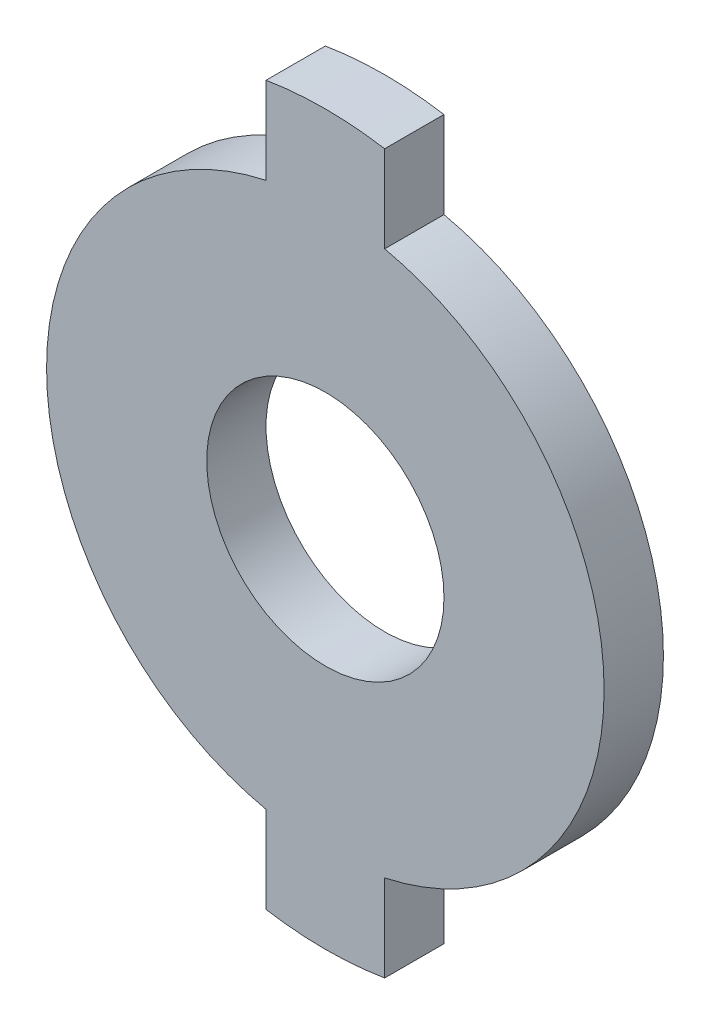
ISO-10303-21;
HEADER;
FILE_DESCRIPTION(('STEP AP214'),'2;1');
FILE_NAME('part.step','',(''),(''),'','','');
FILE_SCHEMA(('AUTOMOTIVE_DESIGN { 1 0 10303 214 1 1 1 1 }'));
ENDSEC;
DATA;
#1=APPLICATION_CONTEXT('core data for automotive mechanical design processes');
#2=APPLICATION_PROTOCOL_DEFINITION('international standard','automotive_design',2000,#1);
#3=PRODUCT_CONTEXT('',#1,'mechanical');
#4=PRODUCT('Part','Part','',(#3));
#5=PRODUCT_RELATED_PRODUCT_CATEGORY('part','',(#4));
#6=PRODUCT_DEFINITION_FORMATION('','',#4);
#7=PRODUCT_DEFINITION_CONTEXT('part definition',#1,'design');
#8=PRODUCT_DEFINITION('design','',#6,#7);
#9=PRODUCT_DEFINITION_SHAPE('','',#8);
#10=(LENGTH_UNIT() NAMED_UNIT(*) SI_UNIT(.MILLI.,.METRE.));
#11=(NAMED_UNIT(*) PLANE_ANGLE_UNIT() SI_UNIT($,.RADIAN.));
#12=(NAMED_UNIT(*) SI_UNIT($,.STERADIAN.) SOLID_ANGLE_UNIT());
#13=UNCERTAINTY_MEASURE_WITH_UNIT(LENGTH_MEASURE(1.E-05),#10,'distance_accuracy_value','');
#14=(GEOMETRIC_REPRESENTATION_CONTEXT(3) GLOBAL_UNCERTAINTY_ASSIGNED_CONTEXT((#13)) GLOBAL_UNIT_ASSIGNED_CONTEXT((#10,
#11,#12)) REPRESENTATION_CONTEXT('',''));
#15=CARTESIAN_POINT('',(0.,0.,0.));
#16=DIRECTION('',(0.,0.,1.));
#17=DIRECTION('',(1.,0.,0.));
#18=AXIS2_PLACEMENT_3D('',#15,#16,#17);
#19=CARTESIAN_POINT('',(0.,0.,5.));
#20=DIRECTION('',(0.,0.,-1.));
#21=DIRECTION('',(-1.,0.,0.));
#22=AXIS2_PLACEMENT_3D('',#19,#20,#21);
#23=CYLINDRICAL_SURFACE('',#22,30.68);
#24=CARTESIAN_POINT('',(0.,0.,0.));
#25=DIRECTION('',(0.,0.,1.));
#26=DIRECTION('',(1.,0.,0.));
#27=AXIS2_PLACEMENT_3D('',#24,#25,#26);
#28=CIRCLE('',#27,30.68);
#29=CARTESIAN_POINT('',(5.,30.2698265604545,0.));
#30=VERTEX_POINT('',#29);
#31=CARTESIAN_POINT('',(-5.,30.2698265604546,0.));
#32=VERTEX_POINT('',#31);
#33=EDGE_CURVE('E132',#30,#32,#28,.T.);
#34=ORIENTED_EDGE('',*,*,#33,.T.);
#35=DIRECTION('',(0.,0.,-1.));
#36=VECTOR('',#35,1.);
#37=CARTESIAN_POINT('',(-5.,30.2698265604546,5.));
#38=LINE('',#37,#36);
#39=CARTESIAN_POINT('',(-5.,30.2698265604546,5.));
#40=VERTEX_POINT('',#39);
#41=EDGE_CURVE('E11',#40,#32,#38,.T.);
#42=ORIENTED_EDGE('',*,*,#41,.F.);
#43=CARTESIAN_POINT('',(0.,0.,5.));
#44=DIRECTION('',(0.,0.,1.));
#45=DIRECTION('',(1.,0.,0.));
#46=AXIS2_PLACEMENT_3D('',#43,#44,#45);
#47=CIRCLE('',#46,30.68);
#48=CARTESIAN_POINT('',(5.,30.2698265604545,5.));
#49=VERTEX_POINT('',#48);
#50=EDGE_CURVE('E147',#49,#40,#47,.T.);
#51=ORIENTED_EDGE('',*,*,#50,.F.);
#52=DIRECTION('',(0.,0.,-1.));
#53=VECTOR('',#52,1.);
#54=CARTESIAN_POINT('',(5.,30.2698265604545,5.));
#55=LINE('',#54,#53);
#56=EDGE_CURVE('E128',#49,#30,#55,.T.);
#57=ORIENTED_EDGE('',*,*,#56,.T.);
#58=EDGE_LOOP('',(#34,#42,#51,#57));
#59=FACE_BOUND('',#58,.T.);
#60=ADVANCED_FACE('F36',(#59),#23,.T.);
#61=CARTESIAN_POINT('',(-5.,30.2698265604546,5.));
#62=DIRECTION('',(1.,0.,0.));
#63=DIRECTION('',(0.,0.,-1.));
#64=AXIS2_PLACEMENT_3D('',#61,#62,#63);
#65=PLANE('',#64);
#66=DIRECTION('',(0.,-1.,0.));
#67=VECTOR('',#66,1.);
#68=CARTESIAN_POINT('',(-5.,30.2698265604546,0.));
#69=LINE('',#68,#67);
#70=CARTESIAN_POINT('',(-5.,22.9619250064101,0.));
#71=VERTEX_POINT('',#70);
#72=EDGE_CURVE('E135',#32,#71,#69,.T.);
#73=ORIENTED_EDGE('',*,*,#72,.T.);
#74=DIRECTION('',(0.,0.,-1.));
#75=VECTOR('',#74,1.);
#76=CARTESIAN_POINT('',(-5.,22.9619250064101,5.));
#77=LINE('',#76,#75);
#78=CARTESIAN_POINT('',(-5.,22.9619250064101,5.));
#79=VERTEX_POINT('',#78);
#80=EDGE_CURVE('E44',#79,#71,#77,.T.);
#81=ORIENTED_EDGE('',*,*,#80,.F.);
#82=DIRECTION('',(0.,-1.,0.));
#83=VECTOR('',#82,1.);
#84=CARTESIAN_POINT('',(-5.,30.2698265604546,5.));
#85=LINE('',#84,#83);
#86=EDGE_CURVE('E95',#40,#79,#85,.T.);
#87=ORIENTED_EDGE('',*,*,#86,.F.);
#88=ORIENTED_EDGE('',*,*,#41,.T.);
#89=EDGE_LOOP('',(#73,#81,#87,#88));
#90=FACE_BOUND('',#89,.T.);
#91=ADVANCED_FACE('F203',(#90),#65,.F.);
#92=CARTESIAN_POINT('',(0.,0.,5.));
#93=DIRECTION('',(0.,0.,-1.));
#94=DIRECTION('',(-1.,0.,0.));
#95=AXIS2_PLACEMENT_3D('',#92,#93,#94);
#96=CYLINDRICAL_SURFACE('',#95,23.5);
#97=CARTESIAN_POINT('',(0.,0.,0.));
#98=DIRECTION('',(0.,0.,1.));
#99=DIRECTION('',(1.,0.,0.));
#100=AXIS2_PLACEMENT_3D('',#97,#98,#99);
#101=CIRCLE('',#100,23.5);
#102=CARTESIAN_POINT('',(-5.,-22.9619250064101,0.));
#103=VERTEX_POINT('',#102);
#104=EDGE_CURVE('E138',#71,#103,#101,.T.);
#105=ORIENTED_EDGE('',*,*,#104,.T.);
#106=DIRECTION('',(0.,0.,-1.));
#107=VECTOR('',#106,1.);
#108=CARTESIAN_POINT('',(-5.,-22.9619250064101,5.));
#109=LINE('',#108,#107);
#110=CARTESIAN_POINT('',(-5.,-22.9619250064101,5.));
#111=VERTEX_POINT('',#110);
#112=EDGE_CURVE('E154',#111,#103,#109,.T.);
#113=ORIENTED_EDGE('',*,*,#112,.F.);
#114=CARTESIAN_POINT('',(0.,0.,5.));
#115=DIRECTION('',(0.,0.,1.));
#116=DIRECTION('',(1.,0.,0.));
#117=AXIS2_PLACEMENT_3D('',#114,#115,#116);
#118=CIRCLE('',#117,23.5);
#119=EDGE_CURVE('E162',#79,#111,#118,.T.);
#120=ORIENTED_EDGE('',*,*,#119,.F.);
#121=ORIENTED_EDGE('',*,*,#80,.T.);
#122=EDGE_LOOP('',(#105,#113,#120,#121));
#123=FACE_BOUND('',#122,.T.);
#124=ADVANCED_FACE('F160',(#123),#96,.T.);
#125=CARTESIAN_POINT('',(-5.,-22.9619250064101,5.));
#126=DIRECTION('',(1.,0.,0.));
#127=DIRECTION('',(0.,0.,-1.));
#128=AXIS2_PLACEMENT_3D('',#125,#126,#127);
#129=PLANE('',#128);
#130=DIRECTION('',(0.,-1.,0.));
#131=VECTOR('',#130,1.);
#132=CARTESIAN_POINT('',(-5.,-22.9619250064101,0.));
#133=LINE('',#132,#131);
#134=CARTESIAN_POINT('',(-5.00000000000002,-30.2698265604545,0.));
#135=VERTEX_POINT('',#134);
#136=EDGE_CURVE('E140',#103,#135,#133,.T.);
#137=ORIENTED_EDGE('',*,*,#136,.T.);
#138=DIRECTION('',(0.,0.,-1.));
#139=VECTOR('',#138,1.);
#140=CARTESIAN_POINT('',(-5.00000000000002,-30.2698265604545,5.));
#141=LINE('',#140,#139);
#142=CARTESIAN_POINT('',(-5.00000000000002,-30.2698265604545,5.));
#143=VERTEX_POINT('',#142);
#144=EDGE_CURVE('E151',#143,#135,#141,.T.);
#145=ORIENTED_EDGE('',*,*,#144,.F.);
#146=DIRECTION('',(0.,-1.,0.));
#147=VECTOR('',#146,1.);
#148=CARTESIAN_POINT('',(-5.,-22.9619250064101,5.));
#149=LINE('',#148,#147);
#150=EDGE_CURVE('E174',#111,#143,#149,.T.);
#151=ORIENTED_EDGE('',*,*,#150,.F.);
#152=ORIENTED_EDGE('',*,*,#112,.T.);
#153=EDGE_LOOP('',(#137,#145,#151,#152));
#154=FACE_BOUND('',#153,.T.);
#155=ADVANCED_FACE('F170',(#154),#129,.F.);
#156=CARTESIAN_POINT('',(0.,0.,5.));
#157=DIRECTION('',(0.,0.,-1.));
#158=DIRECTION('',(-1.,0.,0.));
#159=AXIS2_PLACEMENT_3D('',#156,#157,#158);
#160=CYLINDRICAL_SURFACE('',#159,30.68);
#161=CARTESIAN_POINT('',(0.,0.,0.));
#162=DIRECTION('',(0.,0.,1.));
#163=DIRECTION('',(1.,0.,0.));
#164=AXIS2_PLACEMENT_3D('',#161,#162,#163);
#165=CIRCLE('',#164,30.68);
#166=CARTESIAN_POINT('',(5.,-30.2698265604545,0.));
#167=VERTEX_POINT('',#166);
#168=EDGE_CURVE('E142',#135,#167,#165,.T.);
#169=ORIENTED_EDGE('',*,*,#168,.T.);
#170=DIRECTION('',(0.,0.,-1.));
#171=VECTOR('',#170,1.);
#172=CARTESIAN_POINT('',(5.,-30.2698265604545,5.));
#173=LINE('',#172,#171);
#174=CARTESIAN_POINT('',(5.,-30.2698265604545,5.));
#175=VERTEX_POINT('',#174);
#176=EDGE_CURVE('E123',#175,#167,#173,.T.);
#177=ORIENTED_EDGE('',*,*,#176,.F.);
#178=CARTESIAN_POINT('',(0.,0.,5.));
#179=DIRECTION('',(0.,0.,1.));
#180=DIRECTION('',(1.,0.,0.));
#181=AXIS2_PLACEMENT_3D('',#178,#179,#180);
#182=CIRCLE('',#181,30.68);
#183=EDGE_CURVE('E114',#143,#175,#182,.T.);
#184=ORIENTED_EDGE('',*,*,#183,.F.);
#185=ORIENTED_EDGE('',*,*,#144,.T.);
#186=EDGE_LOOP('',(#169,#177,#184,#185));
#187=FACE_BOUND('',#186,.T.);
#188=ADVANCED_FACE('F173',(#187),#160,.T.);
#189=CARTESIAN_POINT('',(5.,-22.9619250064101,5.));
#190=DIRECTION('',(-1.,0.,0.));
#191=DIRECTION('',(0.,0.,1.));
#192=AXIS2_PLACEMENT_3D('',#189,#190,#191);
#193=PLANE('',#192);
#194=DIRECTION('',(0.,1.,0.));
#195=VECTOR('',#194,1.);
#196=CARTESIAN_POINT('',(5.,-22.9619250064101,0.));
#197=LINE('',#196,#195);
#198=CARTESIAN_POINT('',(5.,-22.9619250064101,0.));
#199=VERTEX_POINT('',#198);
#200=EDGE_CURVE('E122',#167,#199,#197,.T.);
#201=ORIENTED_EDGE('',*,*,#200,.T.);
#202=DIRECTION('',(0.,0.,-1.));
#203=VECTOR('',#202,1.);
#204=CARTESIAN_POINT('',(5.,-22.9619250064101,5.));
#205=LINE('',#204,#203);
#206=CARTESIAN_POINT('',(5.,-22.9619250064101,5.));
#207=VERTEX_POINT('',#206);
#208=EDGE_CURVE('E119',#207,#199,#205,.T.);
#209=ORIENTED_EDGE('',*,*,#208,.F.);
#210=DIRECTION('',(0.,1.,0.));
#211=VECTOR('',#210,1.);
#212=CARTESIAN_POINT('',(5.,-22.9619250064101,5.));
#213=LINE('',#212,#211);
#214=EDGE_CURVE('E108',#175,#207,#213,.T.);
#215=ORIENTED_EDGE('',*,*,#214,.F.);
#216=ORIENTED_EDGE('',*,*,#176,.T.);
#217=EDGE_LOOP('',(#201,#209,#215,#216));
#218=FACE_BOUND('',#217,.T.);
#219=ADVANCED_FACE('F120',(#218),#193,.F.);
#220=CARTESIAN_POINT('',(0.,0.,5.));
#221=DIRECTION('',(0.,0.,-1.));
#222=DIRECTION('',(-1.,0.,0.));
#223=AXIS2_PLACEMENT_3D('',#220,#221,#222);
#224=CYLINDRICAL_SURFACE('',#223,23.5);
#225=CARTESIAN_POINT('',(0.,0.,0.));
#226=DIRECTION('',(0.,0.,1.));
#227=DIRECTION('',(1.,0.,0.));
#228=AXIS2_PLACEMENT_3D('',#225,#226,#227);
#229=CIRCLE('',#228,23.5);
#230=CARTESIAN_POINT('',(5.,22.9619250064101,0.));
#231=VERTEX_POINT('',#230);
#232=EDGE_CURVE('E81',#199,#231,#229,.T.);
#233=ORIENTED_EDGE('',*,*,#232,.T.);
#234=DIRECTION('',(0.,0.,-1.));
#235=VECTOR('',#234,1.);
#236=CARTESIAN_POINT('',(5.,22.9619250064101,5.));
#237=LINE('',#236,#235);
#238=CARTESIAN_POINT('',(5.,22.9619250064101,5.));
#239=VERTEX_POINT('',#238);
#240=EDGE_CURVE('E124',#239,#231,#237,.T.);
#241=ORIENTED_EDGE('',*,*,#240,.F.);
#242=CARTESIAN_POINT('',(0.,0.,5.));
#243=DIRECTION('',(0.,0.,1.));
#244=DIRECTION('',(1.,0.,0.));
#245=AXIS2_PLACEMENT_3D('',#242,#243,#244);
#246=CIRCLE('',#245,23.5);
#247=EDGE_CURVE('E112',#207,#239,#246,.T.);
#248=ORIENTED_EDGE('',*,*,#247,.F.);
#249=ORIENTED_EDGE('',*,*,#208,.T.);
#250=EDGE_LOOP('',(#233,#241,#248,#249));
#251=FACE_BOUND('',#250,.T.);
#252=ADVANCED_FACE('F126',(#251),#224,.T.);
#253=CARTESIAN_POINT('',(5.,30.2698265604545,5.));
#254=DIRECTION('',(-1.,0.,0.));
#255=DIRECTION('',(0.,-1.,0.));
#256=AXIS2_PLACEMENT_3D('',#253,#254,#255);
#257=PLANE('',#256);
#258=DIRECTION('',(0.,1.,0.));
#259=VECTOR('',#258,1.);
#260=CARTESIAN_POINT('',(5.,30.2698265604545,0.));
#261=LINE('',#260,#259);
#262=EDGE_CURVE('E87',#231,#30,#261,.T.);
#263=ORIENTED_EDGE('',*,*,#262,.T.);
#264=ORIENTED_EDGE('',*,*,#56,.F.);
#265=DIRECTION('',(0.,1.,0.));
#266=VECTOR('',#265,1.);
#267=CARTESIAN_POINT('',(5.,30.2698265604545,5.));
#268=LINE('',#267,#266);
#269=EDGE_CURVE('E52',#239,#49,#268,.T.);
#270=ORIENTED_EDGE('',*,*,#269,.F.);
#271=ORIENTED_EDGE('',*,*,#240,.T.);
#272=EDGE_LOOP('',(#263,#264,#270,#271));
#273=FACE_BOUND('',#272,.T.);
#274=ADVANCED_FACE('F194',(#273),#257,.F.);
#275=CARTESIAN_POINT('',(0.,0.,5.));
#276=DIRECTION('',(0.,0.,1.));
#277=DIRECTION('',(1.,0.,0.));
#278=AXIS2_PLACEMENT_3D('',#275,#276,#277);
#279=PLANE('',#278);
#280=CARTESIAN_POINT('',(0.,0.,5.));
#281=DIRECTION('',(0.,0.,1.));
#282=DIRECTION('',(1.,0.,0.));
#283=AXIS2_PLACEMENT_3D('',#280,#281,#282);
#284=CIRCLE('',#283,10.);
#285=CARTESIAN_POINT('',(10.,0.,5.));
#286=VERTEX_POINT('',#285);
#287=EDGE_CURVE('E180',#286,#286,#284,.T.);
#288=ORIENTED_EDGE('',*,*,#287,.F.);
#289=EDGE_LOOP('',(#288));
#290=FACE_BOUND('',#289,.T.);
#291=ORIENTED_EDGE('',*,*,#50,.T.);
#292=ORIENTED_EDGE('',*,*,#86,.T.);
#293=ORIENTED_EDGE('',*,*,#119,.T.);
#294=ORIENTED_EDGE('',*,*,#150,.T.);
#295=ORIENTED_EDGE('',*,*,#183,.T.);
#296=ORIENTED_EDGE('',*,*,#214,.T.);
#297=ORIENTED_EDGE('',*,*,#247,.T.);
#298=ORIENTED_EDGE('',*,*,#269,.T.);
#299=EDGE_LOOP('',(#291,#292,#293,#294,#295,#296,#297,#298));
#300=FACE_BOUND('',#299,.T.);
#301=ADVANCED_FACE('F110',(#290,#300),#279,.T.);
#302=CARTESIAN_POINT('',(0.,0.,0.));
#303=DIRECTION('',(0.,0.,1.));
#304=DIRECTION('',(1.,0.,0.));
#305=AXIS2_PLACEMENT_3D('',#302,#303,#304);
#306=PLANE('',#305);
#307=CARTESIAN_POINT('',(0.,0.,0.));
#308=DIRECTION('',(0.,0.,1.));
#309=DIRECTION('',(1.,0.,0.));
#310=AXIS2_PLACEMENT_3D('',#307,#308,#309);
#311=CIRCLE('',#310,10.);
#312=CARTESIAN_POINT('',(10.,0.,0.));
#313=VERTEX_POINT('',#312);
#314=EDGE_CURVE('E136',#313,#313,#311,.T.);
#315=ORIENTED_EDGE('',*,*,#314,.T.);
#316=EDGE_LOOP('',(#315));
#317=FACE_BOUND('',#316,.T.);
#318=ORIENTED_EDGE('',*,*,#33,.F.);
#319=ORIENTED_EDGE('',*,*,#262,.F.);
#320=ORIENTED_EDGE('',*,*,#232,.F.);
#321=ORIENTED_EDGE('',*,*,#200,.F.);
#322=ORIENTED_EDGE('',*,*,#168,.F.);
#323=ORIENTED_EDGE('',*,*,#136,.F.);
#324=ORIENTED_EDGE('',*,*,#104,.F.);
#325=ORIENTED_EDGE('',*,*,#72,.F.);
#326=EDGE_LOOP('',(#318,#319,#320,#321,#322,#323,#324,#325));
#327=FACE_BOUND('',#326,.T.);
#328=ADVANCED_FACE('F166',(#317,#327),#306,.F.);
#329=CARTESIAN_POINT('',(0.,0.,0.));
#330=DIRECTION('',(0.,0.,1.));
#331=DIRECTION('',(1.,0.,0.));
#332=AXIS2_PLACEMENT_3D('',#329,#330,#331);
#333=CYLINDRICAL_SURFACE('',#332,10.);
#334=ORIENTED_EDGE('',*,*,#314,.F.);
#335=EDGE_LOOP('',(#334));
#336=FACE_BOUND('',#335,.T.);
#337=ORIENTED_EDGE('',*,*,#287,.T.);
#338=EDGE_LOOP('',(#337));
#339=FACE_BOUND('',#338,.T.);
#340=ADVANCED_FACE('F187',(#336,#339),#333,.F.);
#341=CLOSED_SHELL('',(#60,#91,#124,#155,#188,#219,#252,#274,#301,#328,#340));
#342=MANIFOLD_SOLID_BREP('B2',#341);
#343=ADVANCED_BREP_SHAPE_REPRESENTATION('',(#18,#342),#14);
#344=SHAPE_DEFINITION_REPRESENTATION(#9,#343);
ENDSEC;
END-ISO-10303-21;
